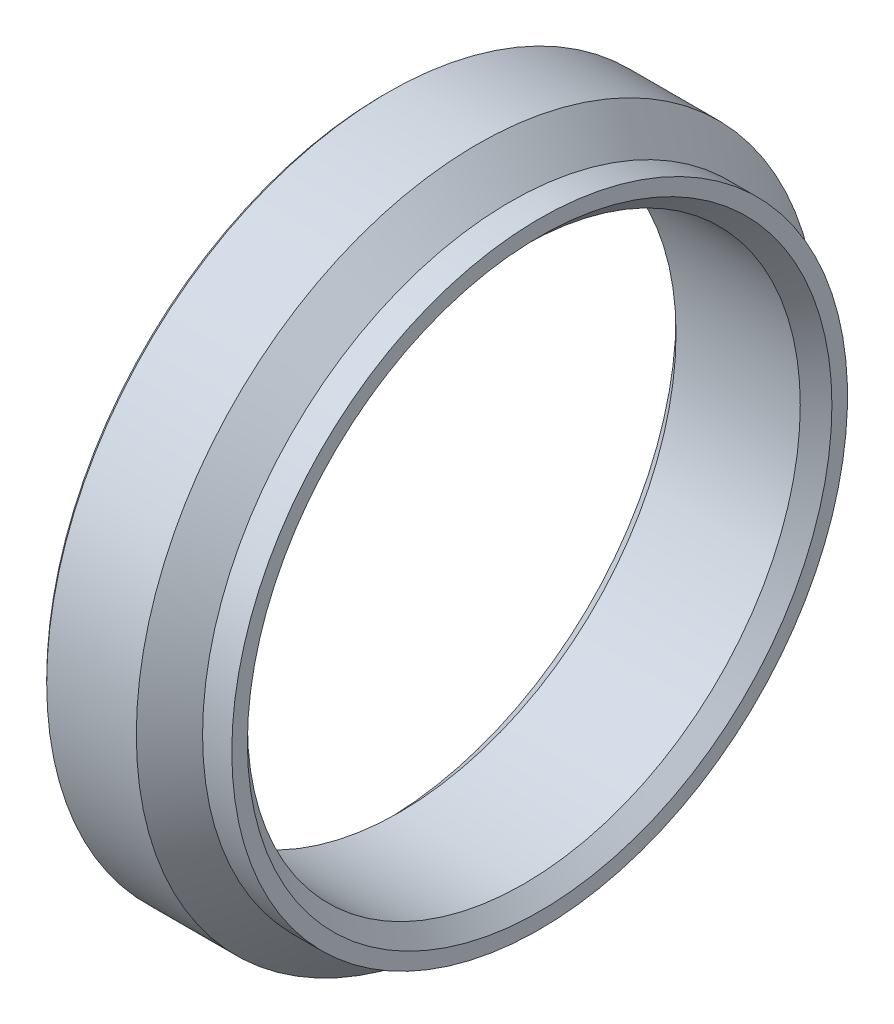
ISO-10303-21;
HEADER;
FILE_DESCRIPTION(('STEP AP214'),'2;1');
FILE_NAME('part.step','',(''),(''),'','','');
FILE_SCHEMA(('AUTOMOTIVE_DESIGN { 1 0 10303 214 1 1 1 1 }'));
ENDSEC;
DATA;
#1=APPLICATION_CONTEXT('core data for automotive mechanical design processes');
#2=APPLICATION_PROTOCOL_DEFINITION('international standard','automotive_design',2000,#1);
#3=PRODUCT_CONTEXT('',#1,'mechanical');
#4=PRODUCT('Part','Part','',(#3));
#5=PRODUCT_RELATED_PRODUCT_CATEGORY('part','',(#4));
#6=PRODUCT_DEFINITION_FORMATION('','',#4);
#7=PRODUCT_DEFINITION_CONTEXT('part definition',#1,'design');
#8=PRODUCT_DEFINITION('design','',#6,#7);
#9=PRODUCT_DEFINITION_SHAPE('','',#8);
#10=(LENGTH_UNIT() NAMED_UNIT(*) SI_UNIT(.MILLI.,.METRE.));
#11=(NAMED_UNIT(*) PLANE_ANGLE_UNIT() SI_UNIT($,.RADIAN.));
#12=(NAMED_UNIT(*) SI_UNIT($,.STERADIAN.) SOLID_ANGLE_UNIT());
#13=UNCERTAINTY_MEASURE_WITH_UNIT(LENGTH_MEASURE(1.E-05),#10,'distance_accuracy_value','');
#14=(GEOMETRIC_REPRESENTATION_CONTEXT(3) GLOBAL_UNCERTAINTY_ASSIGNED_CONTEXT((#13)) GLOBAL_UNIT_ASSIGNED_CONTEXT((#10,
#11,#12)) REPRESENTATION_CONTEXT('',''));
#15=CARTESIAN_POINT('',(0.,0.,0.));
#16=DIRECTION('',(0.,0.,1.));
#17=DIRECTION('',(1.,0.,0.));
#18=AXIS2_PLACEMENT_3D('',#15,#16,#17);
#19=CARTESIAN_POINT('',(50.,0.,0.));
#20=DIRECTION('',(-1.,0.,0.));
#21=DIRECTION('',(0.,0.,1.));
#22=AXIS2_PLACEMENT_3D('',#19,#20,#21);
#23=CYLINDRICAL_SURFACE('',#22,17.5);
#24=CARTESIAN_POINT('',(-3.2,0.,0.));
#25=DIRECTION('',(-1.,0.,0.));
#26=DIRECTION('',(0.,0.,1.));
#27=AXIS2_PLACEMENT_3D('',#24,#25,#26);
#28=CIRCLE('',#27,17.5);
#29=CARTESIAN_POINT('',(-3.2,0.,17.5));
#30=VERTEX_POINT('',#29);
#31=EDGE_CURVE('E61',#30,#30,#28,.T.);
#32=ORIENTED_EDGE('',*,*,#31,.T.);
#33=EDGE_LOOP('',(#32));
#34=FACE_BOUND('',#33,.T.);
#35=CARTESIAN_POINT('',(-7.8,0.,0.));
#36=DIRECTION('',(-1.,0.,0.));
#37=DIRECTION('',(0.,0.,1.));
#38=AXIS2_PLACEMENT_3D('',#35,#36,#37);
#39=CIRCLE('',#38,17.5);
#40=CARTESIAN_POINT('',(-7.8,0.,17.5));
#41=VERTEX_POINT('',#40);
#42=EDGE_CURVE('E67',#41,#41,#39,.T.);
#43=ORIENTED_EDGE('',*,*,#42,.F.);
#44=EDGE_LOOP('',(#43));
#45=FACE_BOUND('',#44,.T.);
#46=ADVANCED_FACE('F36',(#34,#45),#23,.T.);
#47=CARTESIAN_POINT('',(-8.,17.5,0.));
#48=DIRECTION('',(1.,0.,0.));
#49=DIRECTION('',(0.,0.,-1.));
#50=AXIS2_PLACEMENT_3D('',#47,#48,#49);
#51=PLANE('',#50);
#52=CARTESIAN_POINT('',(-8.,0.,0.));
#53=DIRECTION('',(-1.,0.,0.));
#54=DIRECTION('',(0.,0.,1.));
#55=AXIS2_PLACEMENT_3D('',#52,#53,#54);
#56=CIRCLE('',#55,15.);
#57=CARTESIAN_POINT('',(-8.,0.,15.));
#58=VERTEX_POINT('',#57);
#59=EDGE_CURVE('E10',#58,#58,#56,.T.);
#60=ORIENTED_EDGE('',*,*,#59,.F.);
#61=EDGE_LOOP('',(#60));
#62=FACE_BOUND('',#61,.T.);
#63=CARTESIAN_POINT('',(-8.,0.,0.));
#64=DIRECTION('',(-1.,0.,0.));
#65=DIRECTION('',(0.,0.,1.));
#66=AXIS2_PLACEMENT_3D('',#63,#64,#65);
#67=CIRCLE('',#66,17.3);
#68=CARTESIAN_POINT('',(-8.,0.,17.3));
#69=VERTEX_POINT('',#68);
#70=EDGE_CURVE('E64',#69,#69,#67,.T.);
#71=ORIENTED_EDGE('',*,*,#70,.T.);
#72=EDGE_LOOP('',(#71));
#73=FACE_BOUND('',#72,.T.);
#74=ADVANCED_FACE('F75',(#62,#73),#51,.F.);
#75=CARTESIAN_POINT('',(-8.,0.,0.));
#76=DIRECTION('',(-1.,0.,0.));
#77=DIRECTION('',(0.,0.,1.));
#78=AXIS2_PLACEMENT_3D('',#75,#76,#77);
#79=CONICAL_SURFACE('',#78,15.,0.785398163397447);
#80=CARTESIAN_POINT('',(-7.188,0.,0.));
#81=DIRECTION('',(-1.,0.,0.));
#82=DIRECTION('',(0.,0.,1.));
#83=AXIS2_PLACEMENT_3D('',#80,#81,#82);
#84=CIRCLE('',#83,14.188);
#85=CARTESIAN_POINT('',(-7.188,0.,14.188));
#86=VERTEX_POINT('',#85);
#87=EDGE_CURVE('E42',#86,#86,#84,.T.);
#88=ORIENTED_EDGE('',*,*,#87,.F.);
#89=EDGE_LOOP('',(#88));
#90=FACE_BOUND('',#89,.T.);
#91=ORIENTED_EDGE('',*,*,#59,.T.);
#92=EDGE_LOOP('',(#91));
#93=FACE_BOUND('',#92,.T.);
#94=ADVANCED_FACE('F80',(#90,#93),#79,.F.);
#95=CARTESIAN_POINT('',(50.,0.,0.));
#96=DIRECTION('',(-1.,0.,0.));
#97=DIRECTION('',(0.,0.,1.));
#98=AXIS2_PLACEMENT_3D('',#95,#96,#97);
#99=CYLINDRICAL_SURFACE('',#98,14.188);
#100=CARTESIAN_POINT('',(-0.812,0.,0.));
#101=DIRECTION('',(-1.,0.,0.));
#102=DIRECTION('',(0.,0.,1.));
#103=AXIS2_PLACEMENT_3D('',#100,#101,#102);
#104=CIRCLE('',#103,14.188);
#105=CARTESIAN_POINT('',(-0.812,0.,14.188));
#106=VERTEX_POINT('',#105);
#107=EDGE_CURVE('E46',#106,#106,#104,.T.);
#108=ORIENTED_EDGE('',*,*,#107,.F.);
#109=EDGE_LOOP('',(#108));
#110=FACE_BOUND('',#109,.T.);
#111=ORIENTED_EDGE('',*,*,#87,.T.);
#112=EDGE_LOOP('',(#111));
#113=FACE_BOUND('',#112,.T.);
#114=ADVANCED_FACE('F105',(#110,#113),#99,.F.);
#115=CARTESIAN_POINT('',(-0.812,0.,0.));
#116=DIRECTION('',(1.,0.,0.));
#117=DIRECTION('',(0.,0.,-1.));
#118=AXIS2_PLACEMENT_3D('',#115,#116,#117);
#119=CONICAL_SURFACE('',#118,14.188,0.785398163397447);
#120=CARTESIAN_POINT('',(0.,0.,0.));
#121=DIRECTION('',(-1.,0.,0.));
#122=DIRECTION('',(0.,0.,1.));
#123=AXIS2_PLACEMENT_3D('',#120,#121,#122);
#124=CIRCLE('',#123,15.);
#125=CARTESIAN_POINT('',(0.,0.,15.));
#126=VERTEX_POINT('',#125);
#127=EDGE_CURVE('E50',#126,#126,#124,.T.);
#128=ORIENTED_EDGE('',*,*,#127,.F.);
#129=EDGE_LOOP('',(#128));
#130=FACE_BOUND('',#129,.T.);
#131=ORIENTED_EDGE('',*,*,#107,.T.);
#132=EDGE_LOOP('',(#131));
#133=FACE_BOUND('',#132,.T.);
#134=ADVANCED_FACE('F99',(#130,#133),#119,.F.);
#135=CARTESIAN_POINT('',(0.,15.,0.));
#136=DIRECTION('',(-1.,0.,0.));
#137=DIRECTION('',(0.,0.,1.));
#138=AXIS2_PLACEMENT_3D('',#135,#136,#137);
#139=PLANE('',#138);
#140=CARTESIAN_POINT('',(0.,0.,0.));
#141=DIRECTION('',(-1.,0.,0.));
#142=DIRECTION('',(0.,0.,1.));
#143=AXIS2_PLACEMENT_3D('',#140,#141,#142);
#144=CIRCLE('',#143,15.8);
#145=CARTESIAN_POINT('',(0.,0.,15.8));
#146=VERTEX_POINT('',#145);
#147=EDGE_CURVE('E55',#146,#146,#144,.T.);
#148=ORIENTED_EDGE('',*,*,#147,.F.);
#149=EDGE_LOOP('',(#148));
#150=FACE_BOUND('',#149,.T.);
#151=ORIENTED_EDGE('',*,*,#127,.T.);
#152=EDGE_LOOP('',(#151));
#153=FACE_BOUND('',#152,.T.);
#154=ADVANCED_FACE('F93',(#150,#153),#139,.F.);
#155=CARTESIAN_POINT('',(50.,0.,0.));
#156=DIRECTION('',(-1.,0.,0.));
#157=DIRECTION('',(0.,0.,1.));
#158=AXIS2_PLACEMENT_3D('',#155,#156,#157);
#159=CYLINDRICAL_SURFACE('',#158,15.8);
#160=CARTESIAN_POINT('',(-1.5,0.,0.));
#161=DIRECTION('',(-1.,0.,0.));
#162=DIRECTION('',(0.,0.,1.));
#163=AXIS2_PLACEMENT_3D('',#160,#161,#162);
#164=CIRCLE('',#163,15.8);
#165=CARTESIAN_POINT('',(-1.5,0.,15.8));
#166=VERTEX_POINT('',#165);
#167=EDGE_CURVE('E58',#166,#166,#164,.T.);
#168=ORIENTED_EDGE('',*,*,#167,.F.);
#169=EDGE_LOOP('',(#168));
#170=FACE_BOUND('',#169,.T.);
#171=ORIENTED_EDGE('',*,*,#147,.T.);
#172=EDGE_LOOP('',(#171));
#173=FACE_BOUND('',#172,.T.);
#174=ADVANCED_FACE('F87',(#170,#173),#159,.T.);
#175=CARTESIAN_POINT('',(-1.5,0.,0.));
#176=DIRECTION('',(-1.,0.,0.));
#177=DIRECTION('',(0.,0.,1.));
#178=AXIS2_PLACEMENT_3D('',#175,#176,#177);
#179=CONICAL_SURFACE('',#178,15.8,0.785398163397448);
#180=ORIENTED_EDGE('',*,*,#31,.F.);
#181=EDGE_LOOP('',(#180));
#182=FACE_BOUND('',#181,.T.);
#183=ORIENTED_EDGE('',*,*,#167,.T.);
#184=EDGE_LOOP('',(#183));
#185=FACE_BOUND('',#184,.T.);
#186=ADVANCED_FACE('F84',(#182,#185),#179,.T.);
#187=CARTESIAN_POINT('',(-8.,0.,0.));
#188=DIRECTION('',(1.,0.,0.));
#189=DIRECTION('',(0.,0.,-1.));
#190=AXIS2_PLACEMENT_3D('',#187,#188,#189);
#191=CONICAL_SURFACE('',#190,17.3,0.785398163397457);
#192=ORIENTED_EDGE('',*,*,#42,.T.);
#193=EDGE_LOOP('',(#192));
#194=FACE_BOUND('',#193,.T.);
#195=ORIENTED_EDGE('',*,*,#70,.F.);
#196=EDGE_LOOP('',(#195));
#197=FACE_BOUND('',#196,.T.);
#198=ADVANCED_FACE('F71',(#194,#197),#191,.T.);
#199=CLOSED_SHELL('',(#46,#74,#94,#114,#134,#154,#174,#186,#198));
#200=MANIFOLD_SOLID_BREP('B2',#199);
#201=ADVANCED_BREP_SHAPE_REPRESENTATION('',(#18,#200),#14);
#202=SHAPE_DEFINITION_REPRESENTATION(#9,#201);
ENDSEC;
END-ISO-10303-21;
